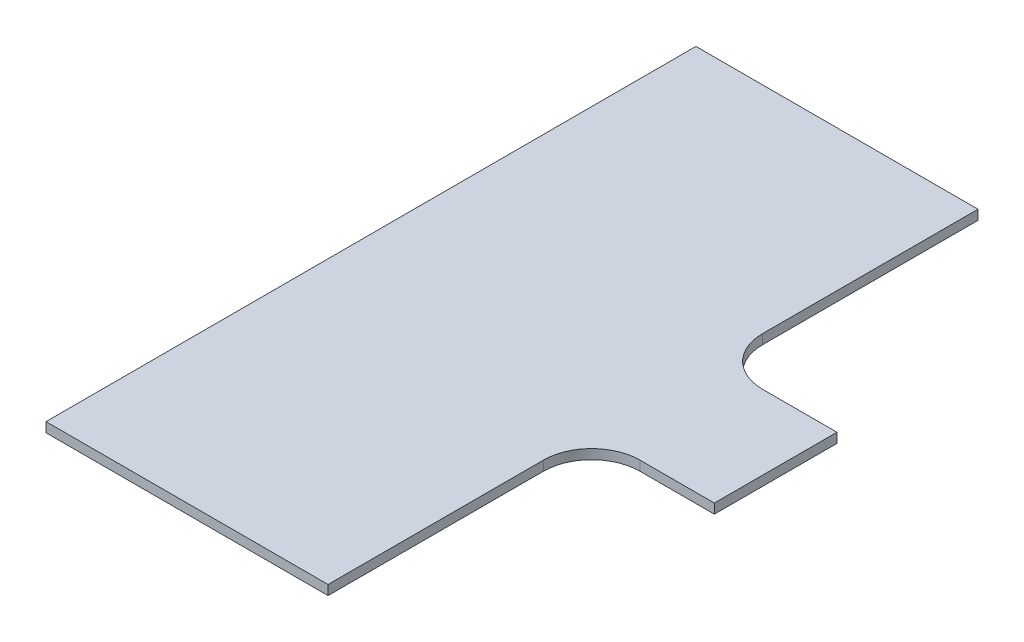
ISO-10303-21;
HEADER;
FILE_DESCRIPTION(('STEP AP214'),'2;1');
FILE_NAME('part.step','',(''),(''),'','','');
FILE_SCHEMA(('AUTOMOTIVE_DESIGN { 1 0 10303 214 1 1 1 1 }'));
ENDSEC;
DATA;
#1=APPLICATION_CONTEXT('core data for automotive mechanical design processes');
#2=APPLICATION_PROTOCOL_DEFINITION('international standard','automotive_design',2000,#1);
#3=PRODUCT_CONTEXT('',#1,'mechanical');
#4=PRODUCT('Part','Part','',(#3));
#5=PRODUCT_RELATED_PRODUCT_CATEGORY('part','',(#4));
#6=PRODUCT_DEFINITION_FORMATION('','',#4);
#7=PRODUCT_DEFINITION_CONTEXT('part definition',#1,'design');
#8=PRODUCT_DEFINITION('design','',#6,#7);
#9=PRODUCT_DEFINITION_SHAPE('','',#8);
#10=(LENGTH_UNIT() NAMED_UNIT(*) SI_UNIT(.MILLI.,.METRE.));
#11=(NAMED_UNIT(*) PLANE_ANGLE_UNIT() SI_UNIT($,.RADIAN.));
#12=(NAMED_UNIT(*) SI_UNIT($,.STERADIAN.) SOLID_ANGLE_UNIT());
#13=UNCERTAINTY_MEASURE_WITH_UNIT(LENGTH_MEASURE(1.E-05),#10,'distance_accuracy_value','');
#14=(GEOMETRIC_REPRESENTATION_CONTEXT(3) GLOBAL_UNCERTAINTY_ASSIGNED_CONTEXT((#13)) GLOBAL_UNIT_ASSIGNED_CONTEXT((#10,
#11,#12)) REPRESENTATION_CONTEXT('',''));
#15=CARTESIAN_POINT('',(0.,0.,0.));
#16=DIRECTION('',(0.,0.,1.));
#17=DIRECTION('',(1.,0.,0.));
#18=AXIS2_PLACEMENT_3D('',#15,#16,#17);
#19=CARTESIAN_POINT('',(-29.21,2.,-67.31));
#20=DIRECTION('',(1.,0.,0.));
#21=DIRECTION('',(0.,0.,-1.));
#22=AXIS2_PLACEMENT_3D('',#19,#20,#21);
#23=PLANE('',#22);
#24=DIRECTION('',(0.,0.,1.));
#25=VECTOR('',#24,1.);
#26=CARTESIAN_POINT('',(-29.21,0.,-67.31));
#27=LINE('',#26,#25);
#28=CARTESIAN_POINT('',(-29.21,0.,-67.31));
#29=VERTEX_POINT('',#28);
#30=CARTESIAN_POINT('',(-29.21,0.,67.31));
#31=VERTEX_POINT('',#30);
#32=EDGE_CURVE('E145',#29,#31,#27,.T.);
#33=ORIENTED_EDGE('',*,*,#32,.T.);
#34=DIRECTION('',(0.,-1.,0.));
#35=VECTOR('',#34,1.);
#36=CARTESIAN_POINT('',(-29.21,2.,67.31));
#37=LINE('',#36,#35);
#38=CARTESIAN_POINT('',(-29.21,2.,67.31));
#39=VERTEX_POINT('',#38);
#40=EDGE_CURVE('E11',#39,#31,#37,.T.);
#41=ORIENTED_EDGE('',*,*,#40,.F.);
#42=DIRECTION('',(0.,0.,1.));
#43=VECTOR('',#42,1.);
#44=CARTESIAN_POINT('',(-29.21,2.,-67.31));
#45=LINE('',#44,#43);
#46=CARTESIAN_POINT('',(-29.21,2.,-67.31));
#47=VERTEX_POINT('',#46);
#48=EDGE_CURVE('E163',#47,#39,#45,.T.);
#49=ORIENTED_EDGE('',*,*,#48,.F.);
#50=DIRECTION('',(0.,-1.,0.));
#51=VECTOR('',#50,1.);
#52=CARTESIAN_POINT('',(-29.21,2.,-67.31));
#53=LINE('',#52,#51);
#54=EDGE_CURVE('E141',#47,#29,#53,.T.);
#55=ORIENTED_EDGE('',*,*,#54,.T.);
#56=EDGE_LOOP('',(#33,#41,#49,#55));
#57=FACE_BOUND('',#56,.T.);
#58=ADVANCED_FACE('F37',(#57),#23,.F.);
#59=CARTESIAN_POINT('',(-29.21,2.,67.31));
#60=DIRECTION('',(0.,0.,-1.));
#61=DIRECTION('',(-1.,0.,0.));
#62=AXIS2_PLACEMENT_3D('',#59,#60,#61);
#63=PLANE('',#62);
#64=DIRECTION('',(1.,0.,0.));
#65=VECTOR('',#64,1.);
#66=CARTESIAN_POINT('',(-29.21,0.,67.31));
#67=LINE('',#66,#65);
#68=CARTESIAN_POINT('',(29.21,0.,67.31));
#69=VERTEX_POINT('',#68);
#70=EDGE_CURVE('E148',#31,#69,#67,.T.);
#71=ORIENTED_EDGE('',*,*,#70,.T.);
#72=DIRECTION('',(0.,-1.,0.));
#73=VECTOR('',#72,1.);
#74=CARTESIAN_POINT('',(29.21,2.,67.31));
#75=LINE('',#74,#73);
#76=CARTESIAN_POINT('',(29.21,2.,67.31));
#77=VERTEX_POINT('',#76);
#78=EDGE_CURVE('E45',#77,#69,#75,.T.);
#79=ORIENTED_EDGE('',*,*,#78,.F.);
#80=DIRECTION('',(1.,0.,0.));
#81=VECTOR('',#80,1.);
#82=CARTESIAN_POINT('',(-29.21,2.,67.31));
#83=LINE('',#82,#81);
#84=EDGE_CURVE('E102',#39,#77,#83,.T.);
#85=ORIENTED_EDGE('',*,*,#84,.F.);
#86=ORIENTED_EDGE('',*,*,#40,.T.);
#87=EDGE_LOOP('',(#71,#79,#85,#86));
#88=FACE_BOUND('',#87,.T.);
#89=ADVANCED_FACE('F212',(#88),#63,.F.);
#90=CARTESIAN_POINT('',(29.21,2.,22.7000000000001));
#91=DIRECTION('',(-1.,0.,0.));
#92=DIRECTION('',(0.,0.,1.));
#93=AXIS2_PLACEMENT_3D('',#90,#91,#92);
#94=PLANE('',#93);
#95=DIRECTION('',(0.,0.,-1.));
#96=VECTOR('',#95,1.);
#97=CARTESIAN_POINT('',(29.21,0.,22.7000000000001));
#98=LINE('',#97,#96);
#99=CARTESIAN_POINT('',(29.21,0.,22.7000000000001));
#100=VERTEX_POINT('',#99);
#101=EDGE_CURVE('E150',#69,#100,#98,.T.);
#102=ORIENTED_EDGE('',*,*,#101,.T.);
#103=DIRECTION('',(0.,-1.,0.));
#104=VECTOR('',#103,1.);
#105=CARTESIAN_POINT('',(29.21,2.,22.7000000000001));
#106=LINE('',#105,#104);
#107=CARTESIAN_POINT('',(29.21,2.,22.7000000000001));
#108=VERTEX_POINT('',#107);
#109=EDGE_CURVE('E176',#108,#100,#106,.T.);
#110=ORIENTED_EDGE('',*,*,#109,.F.);
#111=DIRECTION('',(0.,0.,-1.));
#112=VECTOR('',#111,1.);
#113=CARTESIAN_POINT('',(29.21,2.,22.7000000000001));
#114=LINE('',#113,#112);
#115=EDGE_CURVE('E184',#77,#108,#114,.T.);
#116=ORIENTED_EDGE('',*,*,#115,.F.);
#117=ORIENTED_EDGE('',*,*,#78,.T.);
#118=EDGE_LOOP('',(#102,#110,#116,#117));
#119=FACE_BOUND('',#118,.T.);
#120=ADVANCED_FACE('F182',(#119),#94,.F.);
#121=CARTESIAN_POINT('',(39.21,2.,22.7));
#122=DIRECTION('',(0.,-1.,0.));
#123=DIRECTION('',(0.,0.,-1.));
#124=AXIS2_PLACEMENT_3D('',#121,#122,#123);
#125=CYLINDRICAL_SURFACE('',#124,10.);
#126=CARTESIAN_POINT('',(39.21,0.,22.7));
#127=DIRECTION('',(0.,-1.,0.));
#128=DIRECTION('',(0.,0.,-1.));
#129=AXIS2_PLACEMENT_3D('',#126,#127,#128);
#130=CIRCLE('',#129,10.);
#131=CARTESIAN_POINT('',(39.2100000000001,0.,12.7));
#132=VERTEX_POINT('',#131);
#133=EDGE_CURVE('E152',#100,#132,#130,.T.);
#134=ORIENTED_EDGE('',*,*,#133,.T.);
#135=DIRECTION('',(0.,-1.,0.));
#136=VECTOR('',#135,1.);
#137=CARTESIAN_POINT('',(39.2100000000001,2.,12.7));
#138=LINE('',#137,#136);
#139=CARTESIAN_POINT('',(39.2100000000001,2.,12.7));
#140=VERTEX_POINT('',#139);
#141=EDGE_CURVE('E173',#140,#132,#138,.T.);
#142=ORIENTED_EDGE('',*,*,#141,.F.);
#143=CARTESIAN_POINT('',(39.21,2.,22.7));
#144=DIRECTION('',(0.,-1.,0.));
#145=DIRECTION('',(0.,0.,-1.));
#146=AXIS2_PLACEMENT_3D('',#143,#144,#145);
#147=CIRCLE('',#146,10.);
#148=EDGE_CURVE('E202',#108,#140,#147,.T.);
#149=ORIENTED_EDGE('',*,*,#148,.F.);
#150=ORIENTED_EDGE('',*,*,#109,.T.);
#151=EDGE_LOOP('',(#134,#142,#149,#150));
#152=FACE_BOUND('',#151,.T.);
#153=ADVANCED_FACE('F193',(#152),#125,.F.);
#154=CARTESIAN_POINT('',(39.2100000000001,2.,12.7));
#155=DIRECTION('',(0.,0.,-1.));
#156=DIRECTION('',(-1.,0.,0.));
#157=AXIS2_PLACEMENT_3D('',#154,#155,#156);
#158=PLANE('',#157);
#159=DIRECTION('',(1.,0.,0.));
#160=VECTOR('',#159,1.);
#161=CARTESIAN_POINT('',(39.2100000000001,0.,12.7));
#162=LINE('',#161,#160);
#163=CARTESIAN_POINT('',(54.61,0.,12.7));
#164=VERTEX_POINT('',#163);
#165=EDGE_CURVE('E154',#132,#164,#162,.T.);
#166=ORIENTED_EDGE('',*,*,#165,.T.);
#167=DIRECTION('',(0.,-1.,0.));
#168=VECTOR('',#167,1.);
#169=CARTESIAN_POINT('',(54.61,2.,12.7));
#170=LINE('',#169,#168);
#171=CARTESIAN_POINT('',(54.61,2.,12.7));
#172=VERTEX_POINT('',#171);
#173=EDGE_CURVE('E170',#172,#164,#170,.T.);
#174=ORIENTED_EDGE('',*,*,#173,.F.);
#175=DIRECTION('',(1.,0.,0.));
#176=VECTOR('',#175,1.);
#177=CARTESIAN_POINT('',(39.2100000000001,2.,12.7));
#178=LINE('',#177,#176);
#179=EDGE_CURVE('E199',#140,#172,#178,.T.);
#180=ORIENTED_EDGE('',*,*,#179,.F.);
#181=ORIENTED_EDGE('',*,*,#141,.T.);
#182=EDGE_LOOP('',(#166,#174,#180,#181));
#183=FACE_BOUND('',#182,.T.);
#184=ADVANCED_FACE('F197',(#183),#158,.F.);
#185=CARTESIAN_POINT('',(54.61,2.,-12.7));
#186=DIRECTION('',(-1.,0.,0.));
#187=DIRECTION('',(0.,0.,1.));
#188=AXIS2_PLACEMENT_3D('',#185,#186,#187);
#189=PLANE('',#188);
#190=DIRECTION('',(0.,0.,-1.));
#191=VECTOR('',#190,1.);
#192=CARTESIAN_POINT('',(54.61,0.,-12.7));
#193=LINE('',#192,#191);
#194=CARTESIAN_POINT('',(54.61,0.,-12.7));
#195=VERTEX_POINT('',#194);
#196=EDGE_CURVE('E156',#164,#195,#193,.T.);
#197=ORIENTED_EDGE('',*,*,#196,.T.);
#198=DIRECTION('',(0.,-1.,0.));
#199=VECTOR('',#198,1.);
#200=CARTESIAN_POINT('',(54.61,2.,-12.7));
#201=LINE('',#200,#199);
#202=CARTESIAN_POINT('',(54.61,2.,-12.7));
#203=VERTEX_POINT('',#202);
#204=EDGE_CURVE('E167',#203,#195,#201,.T.);
#205=ORIENTED_EDGE('',*,*,#204,.F.);
#206=DIRECTION('',(0.,0.,-1.));
#207=VECTOR('',#206,1.);
#208=CARTESIAN_POINT('',(54.61,2.,-12.7));
#209=LINE('',#208,#207);
#210=EDGE_CURVE('E201',#172,#203,#209,.T.);
#211=ORIENTED_EDGE('',*,*,#210,.F.);
#212=ORIENTED_EDGE('',*,*,#173,.T.);
#213=EDGE_LOOP('',(#197,#205,#211,#212));
#214=FACE_BOUND('',#213,.T.);
#215=ADVANCED_FACE('F224',(#214),#189,.F.);
#216=CARTESIAN_POINT('',(39.2100000000001,2.,-12.7));
#217=DIRECTION('',(0.,0.,1.));
#218=DIRECTION('',(1.,0.,0.));
#219=AXIS2_PLACEMENT_3D('',#216,#217,#218);
#220=PLANE('',#219);
#221=DIRECTION('',(-1.,0.,0.));
#222=VECTOR('',#221,1.);
#223=CARTESIAN_POINT('',(39.2100000000001,0.,-12.7));
#224=LINE('',#223,#222);
#225=CARTESIAN_POINT('',(39.2100000000001,0.,-12.7));
#226=VERTEX_POINT('',#225);
#227=EDGE_CURVE('E158',#195,#226,#224,.T.);
#228=ORIENTED_EDGE('',*,*,#227,.T.);
#229=DIRECTION('',(0.,-1.,0.));
#230=VECTOR('',#229,1.);
#231=CARTESIAN_POINT('',(39.2100000000001,2.,-12.7));
#232=LINE('',#231,#230);
#233=CARTESIAN_POINT('',(39.2100000000001,2.,-12.7));
#234=VERTEX_POINT('',#233);
#235=EDGE_CURVE('E136',#234,#226,#232,.T.);
#236=ORIENTED_EDGE('',*,*,#235,.F.);
#237=DIRECTION('',(-1.,0.,0.));
#238=VECTOR('',#237,1.);
#239=CARTESIAN_POINT('',(39.2100000000001,2.,-12.7));
#240=LINE('',#239,#238);
#241=EDGE_CURVE('E127',#203,#234,#240,.T.);
#242=ORIENTED_EDGE('',*,*,#241,.F.);
#243=ORIENTED_EDGE('',*,*,#204,.T.);
#244=EDGE_LOOP('',(#228,#236,#242,#243));
#245=FACE_BOUND('',#244,.T.);
#246=ADVANCED_FACE('F227',(#245),#220,.F.);
#247=CARTESIAN_POINT('',(39.21,2.,-22.7));
#248=DIRECTION('',(0.,-1.,0.));
#249=DIRECTION('',(0.,0.,-1.));
#250=AXIS2_PLACEMENT_3D('',#247,#248,#249);
#251=CYLINDRICAL_SURFACE('',#250,10.);
#252=CARTESIAN_POINT('',(39.21,0.,-22.7));
#253=DIRECTION('',(0.,-1.,0.));
#254=DIRECTION('',(0.,0.,-1.));
#255=AXIS2_PLACEMENT_3D('',#252,#253,#254);
#256=CIRCLE('',#255,10.);
#257=CARTESIAN_POINT('',(29.21,0.,-22.7000000000001));
#258=VERTEX_POINT('',#257);
#259=EDGE_CURVE('E135',#226,#258,#256,.T.);
#260=ORIENTED_EDGE('',*,*,#259,.T.);
#261=DIRECTION('',(0.,-1.,0.));
#262=VECTOR('',#261,1.);
#263=CARTESIAN_POINT('',(29.21,2.,-22.7000000000001));
#264=LINE('',#263,#262);
#265=CARTESIAN_POINT('',(29.21,2.,-22.7000000000001));
#266=VERTEX_POINT('',#265);
#267=EDGE_CURVE('E132',#266,#258,#264,.T.);
#268=ORIENTED_EDGE('',*,*,#267,.F.);
#269=CARTESIAN_POINT('',(39.21,2.,-22.7));
#270=DIRECTION('',(0.,-1.,0.));
#271=DIRECTION('',(0.,0.,-1.));
#272=AXIS2_PLACEMENT_3D('',#269,#270,#271);
#273=CIRCLE('',#272,10.);
#274=EDGE_CURVE('E121',#234,#266,#273,.T.);
#275=ORIENTED_EDGE('',*,*,#274,.F.);
#276=ORIENTED_EDGE('',*,*,#235,.T.);
#277=EDGE_LOOP('',(#260,#268,#275,#276));
#278=FACE_BOUND('',#277,.T.);
#279=ADVANCED_FACE('F133',(#278),#251,.F.);
#280=CARTESIAN_POINT('',(29.21,2.,-67.31));
#281=DIRECTION('',(-1.,0.,0.));
#282=DIRECTION('',(0.,0.,1.));
#283=AXIS2_PLACEMENT_3D('',#280,#281,#282);
#284=PLANE('',#283);
#285=DIRECTION('',(0.,0.,-1.));
#286=VECTOR('',#285,1.);
#287=CARTESIAN_POINT('',(29.21,0.,-67.31));
#288=LINE('',#287,#286);
#289=CARTESIAN_POINT('',(29.21,0.,-67.31));
#290=VERTEX_POINT('',#289);
#291=EDGE_CURVE('E88',#258,#290,#288,.T.);
#292=ORIENTED_EDGE('',*,*,#291,.T.);
#293=DIRECTION('',(0.,-1.,0.));
#294=VECTOR('',#293,1.);
#295=CARTESIAN_POINT('',(29.21,2.,-67.31));
#296=LINE('',#295,#294);
#297=CARTESIAN_POINT('',(29.21,2.,-67.31));
#298=VERTEX_POINT('',#297);
#299=EDGE_CURVE('E137',#298,#290,#296,.T.);
#300=ORIENTED_EDGE('',*,*,#299,.F.);
#301=DIRECTION('',(0.,0.,-1.));
#302=VECTOR('',#301,1.);
#303=CARTESIAN_POINT('',(29.21,2.,-67.31));
#304=LINE('',#303,#302);
#305=EDGE_CURVE('E125',#266,#298,#304,.T.);
#306=ORIENTED_EDGE('',*,*,#305,.F.);
#307=ORIENTED_EDGE('',*,*,#267,.T.);
#308=EDGE_LOOP('',(#292,#300,#306,#307));
#309=FACE_BOUND('',#308,.T.);
#310=ADVANCED_FACE('F139',(#309),#284,.F.);
#311=CARTESIAN_POINT('',(-29.21,2.,-67.31));
#312=DIRECTION('',(0.,0.,1.));
#313=DIRECTION('',(1.,0.,0.));
#314=AXIS2_PLACEMENT_3D('',#311,#312,#313);
#315=PLANE('',#314);
#316=DIRECTION('',(-1.,0.,0.));
#317=VECTOR('',#316,1.);
#318=CARTESIAN_POINT('',(-29.21,0.,-67.31));
#319=LINE('',#318,#317);
#320=EDGE_CURVE('E94',#290,#29,#319,.T.);
#321=ORIENTED_EDGE('',*,*,#320,.T.);
#322=ORIENTED_EDGE('',*,*,#54,.F.);
#323=DIRECTION('',(-1.,0.,0.));
#324=VECTOR('',#323,1.);
#325=CARTESIAN_POINT('',(-29.21,2.,-67.31));
#326=LINE('',#325,#324);
#327=EDGE_CURVE('E53',#298,#47,#326,.T.);
#328=ORIENTED_EDGE('',*,*,#327,.F.);
#329=ORIENTED_EDGE('',*,*,#299,.T.);
#330=EDGE_LOOP('',(#321,#322,#328,#329));
#331=FACE_BOUND('',#330,.T.);
#332=ADVANCED_FACE('F236',(#331),#315,.F.);
#333=CARTESIAN_POINT('',(39.21,2.,22.7));
#334=DIRECTION('',(0.,-1.,0.));
#335=DIRECTION('',(0.,0.,-1.));
#336=AXIS2_PLACEMENT_3D('',#333,#334,#335);
#337=PLANE('',#336);
#338=ORIENTED_EDGE('',*,*,#48,.T.);
#339=ORIENTED_EDGE('',*,*,#84,.T.);
#340=ORIENTED_EDGE('',*,*,#115,.T.);
#341=ORIENTED_EDGE('',*,*,#148,.T.);
#342=ORIENTED_EDGE('',*,*,#179,.T.);
#343=ORIENTED_EDGE('',*,*,#210,.T.);
#344=ORIENTED_EDGE('',*,*,#241,.T.);
#345=ORIENTED_EDGE('',*,*,#274,.T.);
#346=ORIENTED_EDGE('',*,*,#305,.T.);
#347=ORIENTED_EDGE('',*,*,#327,.T.);
#348=EDGE_LOOP('',(#338,#339,#340,#341,#342,#343,#344,#345,#346,#347));
#349=FACE_BOUND('',#348,.T.);
#350=ADVANCED_FACE('F123',(#349),#337,.F.);
#351=CARTESIAN_POINT('',(39.21,0.,22.7));
#352=DIRECTION('',(0.,-1.,0.));
#353=DIRECTION('',(0.,0.,-1.));
#354=AXIS2_PLACEMENT_3D('',#351,#352,#353);
#355=PLANE('',#354);
#356=ORIENTED_EDGE('',*,*,#32,.F.);
#357=ORIENTED_EDGE('',*,*,#320,.F.);
#358=ORIENTED_EDGE('',*,*,#291,.F.);
#359=ORIENTED_EDGE('',*,*,#259,.F.);
#360=ORIENTED_EDGE('',*,*,#227,.F.);
#361=ORIENTED_EDGE('',*,*,#196,.F.);
#362=ORIENTED_EDGE('',*,*,#165,.F.);
#363=ORIENTED_EDGE('',*,*,#133,.F.);
#364=ORIENTED_EDGE('',*,*,#101,.F.);
#365=ORIENTED_EDGE('',*,*,#70,.F.);
#366=EDGE_LOOP('',(#356,#357,#358,#359,#360,#361,#362,#363,#364,#365));
#367=FACE_BOUND('',#366,.T.);
#368=ADVANCED_FACE('F188',(#367),#355,.T.);
#369=CLOSED_SHELL('',(#58,#89,#120,#153,#184,#215,#246,#279,#310,#332,#350,#368));
#370=MANIFOLD_SOLID_BREP('B2',#369);
#371=ADVANCED_BREP_SHAPE_REPRESENTATION('',(#18,#370),#14);
#372=SHAPE_DEFINITION_REPRESENTATION(#9,#371);
ENDSEC;
END-ISO-10303-21;
